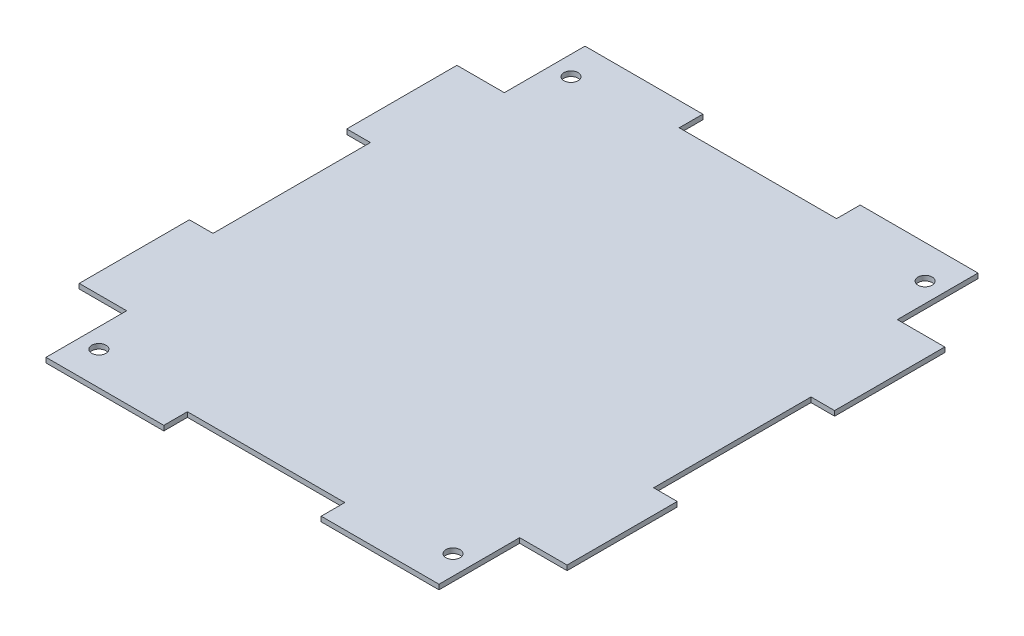
ISO-10303-21;
HEADER;
FILE_DESCRIPTION(('STEP AP214'),'2;1');
FILE_NAME('part.step','',(''),(''),'','','');
FILE_SCHEMA(('AUTOMOTIVE_DESIGN { 1 0 10303 214 1 1 1 1 }'));
ENDSEC;
DATA;
#1=APPLICATION_CONTEXT('core data for automotive mechanical design processes');
#2=APPLICATION_PROTOCOL_DEFINITION('international standard','automotive_design',2000,#1);
#3=PRODUCT_CONTEXT('',#1,'mechanical');
#4=PRODUCT('Part','Part','',(#3));
#5=PRODUCT_RELATED_PRODUCT_CATEGORY('part','',(#4));
#6=PRODUCT_DEFINITION_FORMATION('','',#4);
#7=PRODUCT_DEFINITION_CONTEXT('part definition',#1,'design');
#8=PRODUCT_DEFINITION('design','',#6,#7);
#9=PRODUCT_DEFINITION_SHAPE('','',#8);
#10=(LENGTH_UNIT() NAMED_UNIT(*) SI_UNIT(.MILLI.,.METRE.));
#11=(NAMED_UNIT(*) PLANE_ANGLE_UNIT() SI_UNIT($,.RADIAN.));
#12=(NAMED_UNIT(*) SI_UNIT($,.STERADIAN.) SOLID_ANGLE_UNIT());
#13=UNCERTAINTY_MEASURE_WITH_UNIT(LENGTH_MEASURE(1.E-05),#10,'distance_accuracy_value','');
#14=(GEOMETRIC_REPRESENTATION_CONTEXT(3) GLOBAL_UNCERTAINTY_ASSIGNED_CONTEXT((#13)) GLOBAL_UNIT_ASSIGNED_CONTEXT((#10,
#11,#12)) REPRESENTATION_CONTEXT('',''));
#15=CARTESIAN_POINT('',(0.,0.,0.));
#16=DIRECTION('',(0.,0.,1.));
#17=DIRECTION('',(1.,0.,0.));
#18=AXIS2_PLACEMENT_3D('',#15,#16,#17);
#19=CARTESIAN_POINT('',(0.,1.5875,0.));
#20=DIRECTION('',(0.,1.,0.));
#21=DIRECTION('',(0.,0.,1.));
#22=AXIS2_PLACEMENT_3D('',#19,#20,#21);
#23=PLANE('',#22);
#24=CARTESIAN_POINT('',(57.15,1.5875,76.2));
#25=DIRECTION('',(0.,1.,0.));
#26=DIRECTION('',(0.,0.,1.));
#27=AXIS2_PLACEMENT_3D('',#24,#25,#26);
#28=CIRCLE('',#27,2.28599999999999);
#29=CARTESIAN_POINT('',(57.15,1.5875,78.486));
#30=VERTEX_POINT('',#29);
#31=EDGE_CURVE('E503',#30,#30,#28,.T.);
#32=ORIENTED_EDGE('',*,*,#31,.F.);
#33=EDGE_LOOP('',(#32));
#34=FACE_BOUND('',#33,.T.);
#35=CARTESIAN_POINT('',(-57.15,1.5875,-76.2));
#36=DIRECTION('',(0.,1.,0.));
#37=DIRECTION('',(0.,0.,1.));
#38=AXIS2_PLACEMENT_3D('',#35,#36,#37);
#39=CIRCLE('',#38,2.28599999999999);
#40=CARTESIAN_POINT('',(-57.15,1.5875,-73.914));
#41=VERTEX_POINT('',#40);
#42=EDGE_CURVE('E258',#41,#41,#39,.T.);
#43=ORIENTED_EDGE('',*,*,#42,.F.);
#44=EDGE_LOOP('',(#43));
#45=FACE_BOUND('',#44,.T.);
#46=DIRECTION('',(0.,0.,1.));
#47=VECTOR('',#46,1.);
#48=CARTESIAN_POINT('',(-78.7400000000001,1.5875,25.4));
#49=LINE('',#48,#47);
#50=CARTESIAN_POINT('',(-78.7400000000001,1.5875,25.4));
#51=VERTEX_POINT('',#50);
#52=CARTESIAN_POINT('',(-78.74,1.5875,60.96));
#53=VERTEX_POINT('',#52);
#54=EDGE_CURVE('E309',#51,#53,#49,.T.);
#55=ORIENTED_EDGE('',*,*,#54,.T.);
#56=DIRECTION('',(1.,0.,0.));
#57=VECTOR('',#56,1.);
#58=CARTESIAN_POINT('',(-78.74,1.5875,60.96));
#59=LINE('',#58,#57);
#60=CARTESIAN_POINT('',(-63.43142,1.5875,60.96));
#61=VERTEX_POINT('',#60);
#62=EDGE_CURVE('E157',#53,#61,#59,.T.);
#63=ORIENTED_EDGE('',*,*,#62,.T.);
#64=DIRECTION('',(0.,0.,1.));
#65=VECTOR('',#64,1.);
#66=CARTESIAN_POINT('',(-63.43142,1.5875,60.96));
#67=LINE('',#66,#65);
#68=CARTESIAN_POINT('',(-63.43142,1.5875,86.995));
#69=VERTEX_POINT('',#68);
#70=EDGE_CURVE('E384',#61,#69,#67,.T.);
#71=ORIENTED_EDGE('',*,*,#70,.T.);
#72=DIRECTION('',(1.,0.,0.));
#73=VECTOR('',#72,1.);
#74=CARTESIAN_POINT('',(-63.43142,1.5875,86.995));
#75=LINE('',#74,#73);
#76=CARTESIAN_POINT('',(-25.4,1.5875,86.995));
#77=VERTEX_POINT('',#76);
#78=EDGE_CURVE('E403',#69,#77,#75,.T.);
#79=ORIENTED_EDGE('',*,*,#78,.T.);
#80=DIRECTION('',(0.,0.,-1.));
#81=VECTOR('',#80,1.);
#82=CARTESIAN_POINT('',(-25.4,1.5875,86.995));
#83=LINE('',#82,#81);
#84=CARTESIAN_POINT('',(-25.4,1.5875,79.375));
#85=VERTEX_POINT('',#84);
#86=EDGE_CURVE('E400',#77,#85,#83,.T.);
#87=ORIENTED_EDGE('',*,*,#86,.T.);
#88=DIRECTION('',(1.,0.,0.));
#89=VECTOR('',#88,1.);
#90=CARTESIAN_POINT('',(25.4,1.5875,79.375));
#91=LINE('',#90,#89);
#92=CARTESIAN_POINT('',(25.4,1.5875,79.375));
#93=VERTEX_POINT('',#92);
#94=EDGE_CURVE('E402',#85,#93,#91,.T.);
#95=ORIENTED_EDGE('',*,*,#94,.T.);
#96=DIRECTION('',(0.,0.,1.));
#97=VECTOR('',#96,1.);
#98=CARTESIAN_POINT('',(25.4,1.5875,86.995));
#99=LINE('',#98,#97);
#100=CARTESIAN_POINT('',(25.4,1.5875,86.995));
#101=VERTEX_POINT('',#100);
#102=EDGE_CURVE('E405',#93,#101,#99,.T.);
#103=ORIENTED_EDGE('',*,*,#102,.T.);
#104=DIRECTION('',(1.,0.,0.));
#105=VECTOR('',#104,1.);
#106=CARTESIAN_POINT('',(25.4,1.5875,86.995));
#107=LINE('',#106,#105);
#108=CARTESIAN_POINT('',(63.43142,1.5875,86.995));
#109=VERTEX_POINT('',#108);
#110=EDGE_CURVE('E411',#101,#109,#107,.T.);
#111=ORIENTED_EDGE('',*,*,#110,.T.);
#112=DIRECTION('',(0.,0.,-1.));
#113=VECTOR('',#112,1.);
#114=CARTESIAN_POINT('',(63.43142,1.5875,86.995));
#115=LINE('',#114,#113);
#116=CARTESIAN_POINT('',(63.43142,1.5875,60.96));
#117=VERTEX_POINT('',#116);
#118=EDGE_CURVE('E413',#109,#117,#115,.T.);
#119=ORIENTED_EDGE('',*,*,#118,.T.);
#120=DIRECTION('',(1.,0.,0.));
#121=VECTOR('',#120,1.);
#122=CARTESIAN_POINT('',(63.43142,1.5875,60.96));
#123=LINE('',#122,#121);
#124=CARTESIAN_POINT('',(78.74,1.5875,60.96));
#125=VERTEX_POINT('',#124);
#126=EDGE_CURVE('E415',#117,#125,#123,.T.);
#127=ORIENTED_EDGE('',*,*,#126,.T.);
#128=DIRECTION('',(0.,0.,-1.));
#129=VECTOR('',#128,1.);
#130=CARTESIAN_POINT('',(78.74,1.5875,60.96));
#131=LINE('',#130,#129);
#132=CARTESIAN_POINT('',(78.74,1.5875,25.4));
#133=VERTEX_POINT('',#132);
#134=EDGE_CURVE('E417',#125,#133,#131,.T.);
#135=ORIENTED_EDGE('',*,*,#134,.T.);
#136=DIRECTION('',(-1.,0.,0.));
#137=VECTOR('',#136,1.);
#138=CARTESIAN_POINT('',(78.74,1.5875,25.4));
#139=LINE('',#138,#137);
#140=CARTESIAN_POINT('',(71.12,1.5875,25.4));
#141=VERTEX_POINT('',#140);
#142=EDGE_CURVE('E419',#133,#141,#139,.T.);
#143=ORIENTED_EDGE('',*,*,#142,.T.);
#144=DIRECTION('',(0.,0.,-1.));
#145=VECTOR('',#144,1.);
#146=CARTESIAN_POINT('',(71.12,1.5875,-25.4));
#147=LINE('',#146,#145);
#148=CARTESIAN_POINT('',(71.12,1.5875,-25.4));
#149=VERTEX_POINT('',#148);
#150=EDGE_CURVE('E421',#141,#149,#147,.T.);
#151=ORIENTED_EDGE('',*,*,#150,.T.);
#152=DIRECTION('',(1.,0.,0.));
#153=VECTOR('',#152,1.);
#154=CARTESIAN_POINT('',(78.74,1.5875,-25.4));
#155=LINE('',#154,#153);
#156=CARTESIAN_POINT('',(78.74,1.5875,-25.4));
#157=VERTEX_POINT('',#156);
#158=EDGE_CURVE('E423',#149,#157,#155,.T.);
#159=ORIENTED_EDGE('',*,*,#158,.T.);
#160=DIRECTION('',(0.,0.,-1.));
#161=VECTOR('',#160,1.);
#162=CARTESIAN_POINT('',(78.74,1.5875,-25.4));
#163=LINE('',#162,#161);
#164=CARTESIAN_POINT('',(78.74,1.5875,-60.96));
#165=VERTEX_POINT('',#164);
#166=EDGE_CURVE('E425',#157,#165,#163,.T.);
#167=ORIENTED_EDGE('',*,*,#166,.T.);
#168=DIRECTION('',(-1.,0.,0.));
#169=VECTOR('',#168,1.);
#170=CARTESIAN_POINT('',(78.74,1.5875,-60.96));
#171=LINE('',#170,#169);
#172=CARTESIAN_POINT('',(63.43142,1.5875,-60.96));
#173=VERTEX_POINT('',#172);
#174=EDGE_CURVE('E427',#165,#173,#171,.T.);
#175=ORIENTED_EDGE('',*,*,#174,.T.);
#176=DIRECTION('',(0.,0.,-1.));
#177=VECTOR('',#176,1.);
#178=CARTESIAN_POINT('',(63.43142,1.5875,-60.96));
#179=LINE('',#178,#177);
#180=CARTESIAN_POINT('',(63.43142,1.5875,-86.995));
#181=VERTEX_POINT('',#180);
#182=EDGE_CURVE('E429',#173,#181,#179,.T.);
#183=ORIENTED_EDGE('',*,*,#182,.T.);
#184=DIRECTION('',(-1.,0.,0.));
#185=VECTOR('',#184,1.);
#186=CARTESIAN_POINT('',(63.43142,1.5875,-86.995));
#187=LINE('',#186,#185);
#188=CARTESIAN_POINT('',(25.4,1.5875,-86.995));
#189=VERTEX_POINT('',#188);
#190=EDGE_CURVE('E431',#181,#189,#187,.T.);
#191=ORIENTED_EDGE('',*,*,#190,.T.);
#192=DIRECTION('',(0.,0.,1.));
#193=VECTOR('',#192,1.);
#194=CARTESIAN_POINT('',(25.4,1.5875,-86.995));
#195=LINE('',#194,#193);
#196=CARTESIAN_POINT('',(25.4,1.5875,-79.375));
#197=VERTEX_POINT('',#196);
#198=EDGE_CURVE('E433',#189,#197,#195,.T.);
#199=ORIENTED_EDGE('',*,*,#198,.T.);
#200=DIRECTION('',(-1.,0.,0.));
#201=VECTOR('',#200,1.);
#202=CARTESIAN_POINT('',(-25.4,1.5875,-79.375));
#203=LINE('',#202,#201);
#204=CARTESIAN_POINT('',(-25.4,1.5875,-79.375));
#205=VERTEX_POINT('',#204);
#206=EDGE_CURVE('E435',#197,#205,#203,.T.);
#207=ORIENTED_EDGE('',*,*,#206,.T.);
#208=DIRECTION('',(0.,0.,-1.));
#209=VECTOR('',#208,1.);
#210=CARTESIAN_POINT('',(-25.4,1.5875,-86.995));
#211=LINE('',#210,#209);
#212=CARTESIAN_POINT('',(-25.4,1.5875,-86.995));
#213=VERTEX_POINT('',#212);
#214=EDGE_CURVE('E437',#205,#213,#211,.T.);
#215=ORIENTED_EDGE('',*,*,#214,.T.);
#216=DIRECTION('',(-1.,0.,0.));
#217=VECTOR('',#216,1.);
#218=CARTESIAN_POINT('',(-25.4,1.5875,-86.995));
#219=LINE('',#218,#217);
#220=CARTESIAN_POINT('',(-63.43142,1.5875,-86.995));
#221=VERTEX_POINT('',#220);
#222=EDGE_CURVE('E439',#213,#221,#219,.T.);
#223=ORIENTED_EDGE('',*,*,#222,.T.);
#224=DIRECTION('',(0.,0.,1.));
#225=VECTOR('',#224,1.);
#226=CARTESIAN_POINT('',(-63.43142,1.5875,-86.995));
#227=LINE('',#226,#225);
#228=CARTESIAN_POINT('',(-63.43142,1.5875,-60.96));
#229=VERTEX_POINT('',#228);
#230=EDGE_CURVE('E441',#221,#229,#227,.T.);
#231=ORIENTED_EDGE('',*,*,#230,.T.);
#232=DIRECTION('',(-1.,0.,0.));
#233=VECTOR('',#232,1.);
#234=CARTESIAN_POINT('',(-63.43142,1.5875,-60.96));
#235=LINE('',#234,#233);
#236=CARTESIAN_POINT('',(-78.74,1.5875,-60.96));
#237=VERTEX_POINT('',#236);
#238=EDGE_CURVE('E443',#229,#237,#235,.T.);
#239=ORIENTED_EDGE('',*,*,#238,.T.);
#240=DIRECTION('',(0.,0.,1.));
#241=VECTOR('',#240,1.);
#242=CARTESIAN_POINT('',(-78.74,1.5875,-60.96));
#243=LINE('',#242,#241);
#244=CARTESIAN_POINT('',(-78.7400000000001,1.5875,-25.4));
#245=VERTEX_POINT('',#244);
#246=EDGE_CURVE('E236',#237,#245,#243,.T.);
#247=ORIENTED_EDGE('',*,*,#246,.T.);
#248=DIRECTION('',(1.,0.,0.));
#249=VECTOR('',#248,1.);
#250=CARTESIAN_POINT('',(-78.7400000000001,1.5875,-25.4));
#251=LINE('',#250,#249);
#252=CARTESIAN_POINT('',(-71.12,1.5875,-25.4));
#253=VERTEX_POINT('',#252);
#254=EDGE_CURVE('E230',#245,#253,#251,.T.);
#255=ORIENTED_EDGE('',*,*,#254,.T.);
#256=DIRECTION('',(0.,0.,1.));
#257=VECTOR('',#256,1.);
#258=CARTESIAN_POINT('',(-71.12,1.5875,25.4));
#259=LINE('',#258,#257);
#260=CARTESIAN_POINT('',(-71.12,1.5875,25.4));
#261=VERTEX_POINT('',#260);
#262=EDGE_CURVE('E234',#253,#261,#259,.T.);
#263=ORIENTED_EDGE('',*,*,#262,.T.);
#264=DIRECTION('',(-1.,0.,0.));
#265=VECTOR('',#264,1.);
#266=CARTESIAN_POINT('',(-78.7400000000001,1.5875,25.4));
#267=LINE('',#266,#265);
#268=EDGE_CURVE('E54',#261,#51,#267,.T.);
#269=ORIENTED_EDGE('',*,*,#268,.T.);
#270=EDGE_LOOP('',(#55,#63,#71,#79,#87,#95,#103,#111,#119,#127,#135,#143,#151,#159,#167,#175,
#183,#191,#199,#207,#215,#223,#231,#239,#247,#255,#263,#269));
#271=FACE_BOUND('',#270,.T.);
#272=CARTESIAN_POINT('',(57.15,1.5875,-76.2));
#273=DIRECTION('',(0.,1.,0.));
#274=DIRECTION('',(0.,0.,1.));
#275=AXIS2_PLACEMENT_3D('',#272,#273,#274);
#276=CIRCLE('',#275,2.28599999999999);
#277=CARTESIAN_POINT('',(57.15,1.5875,-73.914));
#278=VERTEX_POINT('',#277);
#279=EDGE_CURVE('E509',#278,#278,#276,.T.);
#280=ORIENTED_EDGE('',*,*,#279,.F.);
#281=EDGE_LOOP('',(#280));
#282=FACE_BOUND('',#281,.T.);
#283=CARTESIAN_POINT('',(-57.1500000000003,1.5875,76.2));
#284=DIRECTION('',(0.,1.,0.));
#285=DIRECTION('',(0.,0.,1.));
#286=AXIS2_PLACEMENT_3D('',#283,#284,#285);
#287=CIRCLE('',#286,2.2860000000002);
#288=CARTESIAN_POINT('',(-57.1500000000003,1.5875,78.4860000000002));
#289=VERTEX_POINT('',#288);
#290=EDGE_CURVE('E494',#289,#289,#287,.T.);
#291=ORIENTED_EDGE('',*,*,#290,.F.);
#292=EDGE_LOOP('',(#291));
#293=FACE_BOUND('',#292,.T.);
#294=ADVANCED_FACE('F37',(#34,#45,#271,#282,#293),#23,.T.);
#295=CARTESIAN_POINT('',(0.,0.,0.));
#296=DIRECTION('',(0.,1.,0.));
#297=DIRECTION('',(0.,0.,1.));
#298=AXIS2_PLACEMENT_3D('',#295,#296,#297);
#299=PLANE('',#298);
#300=DIRECTION('',(0.,0.,1.));
#301=VECTOR('',#300,1.);
#302=CARTESIAN_POINT('',(-78.7400000000001,0.,25.4));
#303=LINE('',#302,#301);
#304=CARTESIAN_POINT('',(-78.7400000000001,0.,25.4));
#305=VERTEX_POINT('',#304);
#306=CARTESIAN_POINT('',(-78.74,0.,60.96));
#307=VERTEX_POINT('',#306);
#308=EDGE_CURVE('E254',#305,#307,#303,.T.);
#309=ORIENTED_EDGE('',*,*,#308,.F.);
#310=DIRECTION('',(-1.,0.,0.));
#311=VECTOR('',#310,1.);
#312=CARTESIAN_POINT('',(-78.7400000000001,0.,25.4));
#313=LINE('',#312,#311);
#314=CARTESIAN_POINT('',(-71.12,0.,25.4));
#315=VERTEX_POINT('',#314);
#316=EDGE_CURVE('E149',#315,#305,#313,.T.);
#317=ORIENTED_EDGE('',*,*,#316,.F.);
#318=DIRECTION('',(0.,0.,1.));
#319=VECTOR('',#318,1.);
#320=CARTESIAN_POINT('',(-71.12,0.,25.4));
#321=LINE('',#320,#319);
#322=CARTESIAN_POINT('',(-71.12,0.,-25.4));
#323=VERTEX_POINT('',#322);
#324=EDGE_CURVE('E143',#323,#315,#321,.T.);
#325=ORIENTED_EDGE('',*,*,#324,.F.);
#326=DIRECTION('',(1.,0.,0.));
#327=VECTOR('',#326,1.);
#328=CARTESIAN_POINT('',(-78.7400000000001,0.,-25.4));
#329=LINE('',#328,#327);
#330=CARTESIAN_POINT('',(-78.7400000000001,0.,-25.4));
#331=VERTEX_POINT('',#330);
#332=EDGE_CURVE('E244',#331,#323,#329,.T.);
#333=ORIENTED_EDGE('',*,*,#332,.F.);
#334=DIRECTION('',(0.,0.,1.));
#335=VECTOR('',#334,1.);
#336=CARTESIAN_POINT('',(-78.74,0.,-60.96));
#337=LINE('',#336,#335);
#338=CARTESIAN_POINT('',(-78.74,0.,-60.96));
#339=VERTEX_POINT('',#338);
#340=EDGE_CURVE('E304',#339,#331,#337,.T.);
#341=ORIENTED_EDGE('',*,*,#340,.F.);
#342=DIRECTION('',(-1.,0.,0.));
#343=VECTOR('',#342,1.);
#344=CARTESIAN_POINT('',(-63.43142,0.,-60.96));
#345=LINE('',#344,#343);
#346=CARTESIAN_POINT('',(-63.43142,0.,-60.96));
#347=VERTEX_POINT('',#346);
#348=EDGE_CURVE('E302',#347,#339,#345,.T.);
#349=ORIENTED_EDGE('',*,*,#348,.F.);
#350=DIRECTION('',(0.,0.,1.));
#351=VECTOR('',#350,1.);
#352=CARTESIAN_POINT('',(-63.43142,0.,-86.995));
#353=LINE('',#352,#351);
#354=CARTESIAN_POINT('',(-63.43142,0.,-86.995));
#355=VERTEX_POINT('',#354);
#356=EDGE_CURVE('E300',#355,#347,#353,.T.);
#357=ORIENTED_EDGE('',*,*,#356,.F.);
#358=DIRECTION('',(-1.,0.,0.));
#359=VECTOR('',#358,1.);
#360=CARTESIAN_POINT('',(-25.4,0.,-86.995));
#361=LINE('',#360,#359);
#362=CARTESIAN_POINT('',(-25.4,0.,-86.995));
#363=VERTEX_POINT('',#362);
#364=EDGE_CURVE('E298',#363,#355,#361,.T.);
#365=ORIENTED_EDGE('',*,*,#364,.F.);
#366=DIRECTION('',(0.,0.,-1.));
#367=VECTOR('',#366,1.);
#368=CARTESIAN_POINT('',(-25.4,0.,-86.995));
#369=LINE('',#368,#367);
#370=CARTESIAN_POINT('',(-25.4,0.,-79.375));
#371=VERTEX_POINT('',#370);
#372=EDGE_CURVE('E296',#371,#363,#369,.T.);
#373=ORIENTED_EDGE('',*,*,#372,.F.);
#374=DIRECTION('',(-1.,0.,0.));
#375=VECTOR('',#374,1.);
#376=CARTESIAN_POINT('',(-25.4,0.,-79.375));
#377=LINE('',#376,#375);
#378=CARTESIAN_POINT('',(25.4,0.,-79.375));
#379=VERTEX_POINT('',#378);
#380=EDGE_CURVE('E294',#379,#371,#377,.T.);
#381=ORIENTED_EDGE('',*,*,#380,.F.);
#382=DIRECTION('',(0.,0.,1.));
#383=VECTOR('',#382,1.);
#384=CARTESIAN_POINT('',(25.4,0.,-86.995));
#385=LINE('',#384,#383);
#386=CARTESIAN_POINT('',(25.4,0.,-86.995));
#387=VERTEX_POINT('',#386);
#388=EDGE_CURVE('E292',#387,#379,#385,.T.);
#389=ORIENTED_EDGE('',*,*,#388,.F.);
#390=DIRECTION('',(-1.,0.,0.));
#391=VECTOR('',#390,1.);
#392=CARTESIAN_POINT('',(63.43142,0.,-86.995));
#393=LINE('',#392,#391);
#394=CARTESIAN_POINT('',(63.43142,0.,-86.995));
#395=VERTEX_POINT('',#394);
#396=EDGE_CURVE('E290',#395,#387,#393,.T.);
#397=ORIENTED_EDGE('',*,*,#396,.F.);
#398=DIRECTION('',(0.,0.,-1.));
#399=VECTOR('',#398,1.);
#400=CARTESIAN_POINT('',(63.43142,0.,-60.96));
#401=LINE('',#400,#399);
#402=CARTESIAN_POINT('',(63.43142,0.,-60.96));
#403=VERTEX_POINT('',#402);
#404=EDGE_CURVE('E288',#403,#395,#401,.T.);
#405=ORIENTED_EDGE('',*,*,#404,.F.);
#406=DIRECTION('',(-1.,0.,0.));
#407=VECTOR('',#406,1.);
#408=CARTESIAN_POINT('',(78.74,0.,-60.96));
#409=LINE('',#408,#407);
#410=CARTESIAN_POINT('',(78.74,0.,-60.96));
#411=VERTEX_POINT('',#410);
#412=EDGE_CURVE('E286',#411,#403,#409,.T.);
#413=ORIENTED_EDGE('',*,*,#412,.F.);
#414=DIRECTION('',(0.,0.,-1.));
#415=VECTOR('',#414,1.);
#416=CARTESIAN_POINT('',(78.74,0.,-25.4));
#417=LINE('',#416,#415);
#418=CARTESIAN_POINT('',(78.74,0.,-25.4));
#419=VERTEX_POINT('',#418);
#420=EDGE_CURVE('E284',#419,#411,#417,.T.);
#421=ORIENTED_EDGE('',*,*,#420,.F.);
#422=DIRECTION('',(1.,0.,0.));
#423=VECTOR('',#422,1.);
#424=CARTESIAN_POINT('',(78.74,0.,-25.4));
#425=LINE('',#424,#423);
#426=CARTESIAN_POINT('',(71.12,0.,-25.4));
#427=VERTEX_POINT('',#426);
#428=EDGE_CURVE('E282',#427,#419,#425,.T.);
#429=ORIENTED_EDGE('',*,*,#428,.F.);
#430=DIRECTION('',(0.,0.,-1.));
#431=VECTOR('',#430,1.);
#432=CARTESIAN_POINT('',(71.12,0.,-25.4));
#433=LINE('',#432,#431);
#434=CARTESIAN_POINT('',(71.12,0.,25.4));
#435=VERTEX_POINT('',#434);
#436=EDGE_CURVE('E280',#435,#427,#433,.T.);
#437=ORIENTED_EDGE('',*,*,#436,.F.);
#438=DIRECTION('',(-1.,0.,0.));
#439=VECTOR('',#438,1.);
#440=CARTESIAN_POINT('',(78.74,0.,25.4));
#441=LINE('',#440,#439);
#442=CARTESIAN_POINT('',(78.74,0.,25.4));
#443=VERTEX_POINT('',#442);
#444=EDGE_CURVE('E278',#443,#435,#441,.T.);
#445=ORIENTED_EDGE('',*,*,#444,.F.);
#446=DIRECTION('',(0.,0.,-1.));
#447=VECTOR('',#446,1.);
#448=CARTESIAN_POINT('',(78.74,0.,60.96));
#449=LINE('',#448,#447);
#450=CARTESIAN_POINT('',(78.74,0.,60.96));
#451=VERTEX_POINT('',#450);
#452=EDGE_CURVE('E276',#451,#443,#449,.T.);
#453=ORIENTED_EDGE('',*,*,#452,.F.);
#454=DIRECTION('',(1.,0.,0.));
#455=VECTOR('',#454,1.);
#456=CARTESIAN_POINT('',(63.43142,0.,60.96));
#457=LINE('',#456,#455);
#458=CARTESIAN_POINT('',(63.43142,0.,60.96));
#459=VERTEX_POINT('',#458);
#460=EDGE_CURVE('E274',#459,#451,#457,.T.);
#461=ORIENTED_EDGE('',*,*,#460,.F.);
#462=DIRECTION('',(0.,0.,-1.));
#463=VECTOR('',#462,1.);
#464=CARTESIAN_POINT('',(63.43142,0.,86.995));
#465=LINE('',#464,#463);
#466=CARTESIAN_POINT('',(63.43142,0.,86.995));
#467=VERTEX_POINT('',#466);
#468=EDGE_CURVE('E272',#467,#459,#465,.T.);
#469=ORIENTED_EDGE('',*,*,#468,.F.);
#470=DIRECTION('',(1.,0.,0.));
#471=VECTOR('',#470,1.);
#472=CARTESIAN_POINT('',(25.4,0.,86.995));
#473=LINE('',#472,#471);
#474=CARTESIAN_POINT('',(25.4,0.,86.995));
#475=VERTEX_POINT('',#474);
#476=EDGE_CURVE('E270',#475,#467,#473,.T.);
#477=ORIENTED_EDGE('',*,*,#476,.F.);
#478=DIRECTION('',(0.,0.,1.));
#479=VECTOR('',#478,1.);
#480=CARTESIAN_POINT('',(25.4,0.,86.995));
#481=LINE('',#480,#479);
#482=CARTESIAN_POINT('',(25.4,0.,79.375));
#483=VERTEX_POINT('',#482);
#484=EDGE_CURVE('E268',#483,#475,#481,.T.);
#485=ORIENTED_EDGE('',*,*,#484,.F.);
#486=DIRECTION('',(1.,0.,0.));
#487=VECTOR('',#486,1.);
#488=CARTESIAN_POINT('',(25.4,0.,79.375));
#489=LINE('',#488,#487);
#490=CARTESIAN_POINT('',(-25.4,0.,79.375));
#491=VERTEX_POINT('',#490);
#492=EDGE_CURVE('E266',#491,#483,#489,.T.);
#493=ORIENTED_EDGE('',*,*,#492,.F.);
#494=DIRECTION('',(0.,0.,-1.));
#495=VECTOR('',#494,1.);
#496=CARTESIAN_POINT('',(-25.4,0.,86.995));
#497=LINE('',#496,#495);
#498=CARTESIAN_POINT('',(-25.4,0.,86.995));
#499=VERTEX_POINT('',#498);
#500=EDGE_CURVE('E264',#499,#491,#497,.T.);
#501=ORIENTED_EDGE('',*,*,#500,.F.);
#502=DIRECTION('',(1.,0.,0.));
#503=VECTOR('',#502,1.);
#504=CARTESIAN_POINT('',(-63.43142,0.,86.995));
#505=LINE('',#504,#503);
#506=CARTESIAN_POINT('',(-63.43142,0.,86.995));
#507=VERTEX_POINT('',#506);
#508=EDGE_CURVE('E262',#507,#499,#505,.T.);
#509=ORIENTED_EDGE('',*,*,#508,.F.);
#510=DIRECTION('',(0.,0.,1.));
#511=VECTOR('',#510,1.);
#512=CARTESIAN_POINT('',(-63.43142,0.,60.96));
#513=LINE('',#512,#511);
#514=CARTESIAN_POINT('',(-63.43142,0.,60.96));
#515=VERTEX_POINT('',#514);
#516=EDGE_CURVE('E260',#515,#507,#513,.T.);
#517=ORIENTED_EDGE('',*,*,#516,.F.);
#518=DIRECTION('',(1.,0.,0.));
#519=VECTOR('',#518,1.);
#520=CARTESIAN_POINT('',(-78.74,0.,60.96));
#521=LINE('',#520,#519);
#522=EDGE_CURVE('E257',#307,#515,#521,.T.);
#523=ORIENTED_EDGE('',*,*,#522,.F.);
#524=EDGE_LOOP('',(#309,#317,#325,#333,#341,#349,#357,#365,#373,#381,#389,#397,#405,#413,#421,
#429,#437,#445,#453,#461,#469,#477,#485,#493,#501,#509,#517,#523));
#525=FACE_BOUND('',#524,.T.);
#526=CARTESIAN_POINT('',(-57.15,0.,-76.2));
#527=DIRECTION('',(0.,1.,0.));
#528=DIRECTION('',(0.,0.,1.));
#529=AXIS2_PLACEMENT_3D('',#526,#527,#528);
#530=CIRCLE('',#529,2.28599999999999);
#531=CARTESIAN_POINT('',(-57.15,0.,-73.914));
#532=VERTEX_POINT('',#531);
#533=EDGE_CURVE('E512',#532,#532,#530,.T.);
#534=ORIENTED_EDGE('',*,*,#533,.T.);
#535=EDGE_LOOP('',(#534));
#536=FACE_BOUND('',#535,.T.);
#537=CARTESIAN_POINT('',(57.15,0.,-76.2));
#538=DIRECTION('',(0.,1.,0.));
#539=DIRECTION('',(0.,0.,1.));
#540=AXIS2_PLACEMENT_3D('',#537,#538,#539);
#541=CIRCLE('',#540,2.28599999999999);
#542=CARTESIAN_POINT('',(57.15,0.,-73.914));
#543=VERTEX_POINT('',#542);
#544=EDGE_CURVE('E506',#543,#543,#541,.T.);
#545=ORIENTED_EDGE('',*,*,#544,.T.);
#546=EDGE_LOOP('',(#545));
#547=FACE_BOUND('',#546,.T.);
#548=CARTESIAN_POINT('',(57.15,0.,76.2));
#549=DIRECTION('',(0.,1.,0.));
#550=DIRECTION('',(0.,0.,1.));
#551=AXIS2_PLACEMENT_3D('',#548,#549,#550);
#552=CIRCLE('',#551,2.28599999999999);
#553=CARTESIAN_POINT('',(57.15,0.,78.486));
#554=VERTEX_POINT('',#553);
#555=EDGE_CURVE('E500',#554,#554,#552,.T.);
#556=ORIENTED_EDGE('',*,*,#555,.T.);
#557=EDGE_LOOP('',(#556));
#558=FACE_BOUND('',#557,.T.);
#559=CARTESIAN_POINT('',(-57.1500000000003,0.,76.2));
#560=DIRECTION('',(0.,1.,0.));
#561=DIRECTION('',(0.,0.,1.));
#562=AXIS2_PLACEMENT_3D('',#559,#560,#561);
#563=CIRCLE('',#562,2.2860000000002);
#564=CARTESIAN_POINT('',(-57.1500000000003,0.,78.4860000000002));
#565=VERTEX_POINT('',#564);
#566=EDGE_CURVE('E497',#565,#565,#563,.T.);
#567=ORIENTED_EDGE('',*,*,#566,.T.);
#568=EDGE_LOOP('',(#567));
#569=FACE_BOUND('',#568,.T.);
#570=ADVANCED_FACE('F388',(#525,#536,#547,#558,#569),#299,.F.);
#571=CARTESIAN_POINT('',(-78.7400000000001,1.5875,25.4));
#572=DIRECTION('',(1.,0.,0.));
#573=DIRECTION('',(0.,0.,-1.));
#574=AXIS2_PLACEMENT_3D('',#571,#572,#573);
#575=PLANE('',#574);
#576=ORIENTED_EDGE('',*,*,#308,.T.);
#577=DIRECTION('',(0.,-1.,0.));
#578=VECTOR('',#577,1.);
#579=CARTESIAN_POINT('',(-78.74,1.5875,60.96));
#580=LINE('',#579,#578);
#581=EDGE_CURVE('E11',#53,#307,#580,.T.);
#582=ORIENTED_EDGE('',*,*,#581,.F.);
#583=ORIENTED_EDGE('',*,*,#54,.F.);
#584=DIRECTION('',(0.,-1.,0.));
#585=VECTOR('',#584,1.);
#586=CARTESIAN_POINT('',(-78.7400000000001,1.5875,25.4));
#587=LINE('',#586,#585);
#588=EDGE_CURVE('E250',#51,#305,#587,.T.);
#589=ORIENTED_EDGE('',*,*,#588,.T.);
#590=EDGE_LOOP('',(#576,#582,#583,#589));
#591=FACE_BOUND('',#590,.T.);
#592=ADVANCED_FACE('F39',(#591),#575,.F.);
#593=CARTESIAN_POINT('',(-78.74,1.5875,60.96));
#594=DIRECTION('',(0.,0.,-1.));
#595=DIRECTION('',(-1.,0.,0.));
#596=AXIS2_PLACEMENT_3D('',#593,#594,#595);
#597=PLANE('',#596);
#598=ORIENTED_EDGE('',*,*,#522,.T.);
#599=DIRECTION('',(0.,-1.,0.));
#600=VECTOR('',#599,1.);
#601=CARTESIAN_POINT('',(-63.43142,1.5875,60.96));
#602=LINE('',#601,#600);
#603=EDGE_CURVE('E46',#61,#515,#602,.T.);
#604=ORIENTED_EDGE('',*,*,#603,.F.);
#605=ORIENTED_EDGE('',*,*,#62,.F.);
#606=ORIENTED_EDGE('',*,*,#581,.T.);
#607=EDGE_LOOP('',(#598,#604,#605,#606));
#608=FACE_BOUND('',#607,.T.);
#609=ADVANCED_FACE('F782',(#608),#597,.F.);
#610=CARTESIAN_POINT('',(-63.43142,1.5875,60.96));
#611=DIRECTION('',(1.,0.,0.));
#612=DIRECTION('',(0.,0.,-1.));
#613=AXIS2_PLACEMENT_3D('',#610,#611,#612);
#614=PLANE('',#613);
#615=ORIENTED_EDGE('',*,*,#516,.T.);
#616=DIRECTION('',(0.,-1.,0.));
#617=VECTOR('',#616,1.);
#618=CARTESIAN_POINT('',(-63.43142,1.5875,86.995));
#619=LINE('',#618,#617);
#620=EDGE_CURVE('E376',#69,#507,#619,.T.);
#621=ORIENTED_EDGE('',*,*,#620,.F.);
#622=ORIENTED_EDGE('',*,*,#70,.F.);
#623=ORIENTED_EDGE('',*,*,#603,.T.);
#624=EDGE_LOOP('',(#615,#621,#622,#623));
#625=FACE_BOUND('',#624,.T.);
#626=ADVANCED_FACE('F382',(#625),#614,.F.);
#627=CARTESIAN_POINT('',(-63.43142,1.5875,86.995));
#628=DIRECTION('',(0.,0.,-1.));
#629=DIRECTION('',(-1.,0.,0.));
#630=AXIS2_PLACEMENT_3D('',#627,#628,#629);
#631=PLANE('',#630);
#632=ORIENTED_EDGE('',*,*,#508,.T.);
#633=DIRECTION('',(0.,-1.,0.));
#634=VECTOR('',#633,1.);
#635=CARTESIAN_POINT('',(-25.4,1.5875,86.995));
#636=LINE('',#635,#634);
#637=EDGE_CURVE('E373',#77,#499,#636,.T.);
#638=ORIENTED_EDGE('',*,*,#637,.F.);
#639=ORIENTED_EDGE('',*,*,#78,.F.);
#640=ORIENTED_EDGE('',*,*,#620,.T.);
#641=EDGE_LOOP('',(#632,#638,#639,#640));
#642=FACE_BOUND('',#641,.T.);
#643=ADVANCED_FACE('F394',(#642),#631,.F.);
#644=CARTESIAN_POINT('',(-25.4,1.5875,86.995));
#645=DIRECTION('',(-1.,0.,0.));
#646=DIRECTION('',(0.,0.,1.));
#647=AXIS2_PLACEMENT_3D('',#644,#645,#646);
#648=PLANE('',#647);
#649=ORIENTED_EDGE('',*,*,#500,.T.);
#650=DIRECTION('',(0.,-1.,0.));
#651=VECTOR('',#650,1.);
#652=CARTESIAN_POINT('',(-25.4,1.5875,79.375));
#653=LINE('',#652,#651);
#654=EDGE_CURVE('E370',#85,#491,#653,.T.);
#655=ORIENTED_EDGE('',*,*,#654,.F.);
#656=ORIENTED_EDGE('',*,*,#86,.F.);
#657=ORIENTED_EDGE('',*,*,#637,.T.);
#658=EDGE_LOOP('',(#649,#655,#656,#657));
#659=FACE_BOUND('',#658,.T.);
#660=ADVANCED_FACE('F398',(#659),#648,.F.);
#661=CARTESIAN_POINT('',(25.4,1.5875,79.375));
#662=DIRECTION('',(0.,0.,-1.));
#663=DIRECTION('',(-1.,0.,0.));
#664=AXIS2_PLACEMENT_3D('',#661,#662,#663);
#665=PLANE('',#664);
#666=ORIENTED_EDGE('',*,*,#492,.T.);
#667=DIRECTION('',(0.,-1.,0.));
#668=VECTOR('',#667,1.);
#669=CARTESIAN_POINT('',(25.4,1.5875,79.375));
#670=LINE('',#669,#668);
#671=EDGE_CURVE('E367',#93,#483,#670,.T.);
#672=ORIENTED_EDGE('',*,*,#671,.F.);
#673=ORIENTED_EDGE('',*,*,#94,.F.);
#674=ORIENTED_EDGE('',*,*,#654,.T.);
#675=EDGE_LOOP('',(#666,#672,#673,#674));
#676=FACE_BOUND('',#675,.T.);
#677=ADVANCED_FACE('F747',(#676),#665,.F.);
#678=CARTESIAN_POINT('',(25.4,1.5875,86.995));
#679=DIRECTION('',(1.,0.,0.));
#680=DIRECTION('',(0.,0.,-1.));
#681=AXIS2_PLACEMENT_3D('',#678,#679,#680);
#682=PLANE('',#681);
#683=ORIENTED_EDGE('',*,*,#484,.T.);
#684=DIRECTION('',(0.,-1.,0.));
#685=VECTOR('',#684,1.);
#686=CARTESIAN_POINT('',(25.4,1.5875,86.995));
#687=LINE('',#686,#685);
#688=EDGE_CURVE('E364',#101,#475,#687,.T.);
#689=ORIENTED_EDGE('',*,*,#688,.F.);
#690=ORIENTED_EDGE('',*,*,#102,.F.);
#691=ORIENTED_EDGE('',*,*,#671,.T.);
#692=EDGE_LOOP('',(#683,#689,#690,#691));
#693=FACE_BOUND('',#692,.T.);
#694=ADVANCED_FACE('F737',(#693),#682,.F.);
#695=CARTESIAN_POINT('',(25.4,1.5875,86.995));
#696=DIRECTION('',(0.,0.,-1.));
#697=DIRECTION('',(-1.,0.,0.));
#698=AXIS2_PLACEMENT_3D('',#695,#696,#697);
#699=PLANE('',#698);
#700=ORIENTED_EDGE('',*,*,#476,.T.);
#701=DIRECTION('',(0.,-1.,0.));
#702=VECTOR('',#701,1.);
#703=CARTESIAN_POINT('',(63.43142,1.5875,86.995));
#704=LINE('',#703,#702);
#705=EDGE_CURVE('E361',#109,#467,#704,.T.);
#706=ORIENTED_EDGE('',*,*,#705,.F.);
#707=ORIENTED_EDGE('',*,*,#110,.F.);
#708=ORIENTED_EDGE('',*,*,#688,.T.);
#709=EDGE_LOOP('',(#700,#706,#707,#708));
#710=FACE_BOUND('',#709,.T.);
#711=ADVANCED_FACE('F727',(#710),#699,.F.);
#712=CARTESIAN_POINT('',(63.43142,1.5875,86.995));
#713=DIRECTION('',(-1.,0.,0.));
#714=DIRECTION('',(0.,0.,1.));
#715=AXIS2_PLACEMENT_3D('',#712,#713,#714);
#716=PLANE('',#715);
#717=ORIENTED_EDGE('',*,*,#468,.T.);
#718=DIRECTION('',(0.,-1.,0.));
#719=VECTOR('',#718,1.);
#720=CARTESIAN_POINT('',(63.43142,1.5875,60.96));
#721=LINE('',#720,#719);
#722=EDGE_CURVE('E358',#117,#459,#721,.T.);
#723=ORIENTED_EDGE('',*,*,#722,.F.);
#724=ORIENTED_EDGE('',*,*,#118,.F.);
#725=ORIENTED_EDGE('',*,*,#705,.T.);
#726=EDGE_LOOP('',(#717,#723,#724,#725));
#727=FACE_BOUND('',#726,.T.);
#728=ADVANCED_FACE('F717',(#727),#716,.F.);
#729=CARTESIAN_POINT('',(63.43142,1.5875,60.96));
#730=DIRECTION('',(0.,0.,-1.));
#731=DIRECTION('',(-1.,0.,0.));
#732=AXIS2_PLACEMENT_3D('',#729,#730,#731);
#733=PLANE('',#732);
#734=ORIENTED_EDGE('',*,*,#460,.T.);
#735=DIRECTION('',(0.,-1.,0.));
#736=VECTOR('',#735,1.);
#737=CARTESIAN_POINT('',(78.74,1.5875,60.96));
#738=LINE('',#737,#736);
#739=EDGE_CURVE('E355',#125,#451,#738,.T.);
#740=ORIENTED_EDGE('',*,*,#739,.F.);
#741=ORIENTED_EDGE('',*,*,#126,.F.);
#742=ORIENTED_EDGE('',*,*,#722,.T.);
#743=EDGE_LOOP('',(#734,#740,#741,#742));
#744=FACE_BOUND('',#743,.T.);
#745=ADVANCED_FACE('F707',(#744),#733,.F.);
#746=CARTESIAN_POINT('',(78.74,1.5875,60.96));
#747=DIRECTION('',(-1.,0.,0.));
#748=DIRECTION('',(0.,0.,1.));
#749=AXIS2_PLACEMENT_3D('',#746,#747,#748);
#750=PLANE('',#749);
#751=ORIENTED_EDGE('',*,*,#452,.T.);
#752=DIRECTION('',(0.,-1.,0.));
#753=VECTOR('',#752,1.);
#754=CARTESIAN_POINT('',(78.74,1.5875,25.4));
#755=LINE('',#754,#753);
#756=EDGE_CURVE('E352',#133,#443,#755,.T.);
#757=ORIENTED_EDGE('',*,*,#756,.F.);
#758=ORIENTED_EDGE('',*,*,#134,.F.);
#759=ORIENTED_EDGE('',*,*,#739,.T.);
#760=EDGE_LOOP('',(#751,#757,#758,#759));
#761=FACE_BOUND('',#760,.T.);
#762=ADVANCED_FACE('F697',(#761),#750,.F.);
#763=CARTESIAN_POINT('',(78.74,1.5875,25.4));
#764=DIRECTION('',(0.,0.,1.));
#765=DIRECTION('',(1.,0.,0.));
#766=AXIS2_PLACEMENT_3D('',#763,#764,#765);
#767=PLANE('',#766);
#768=ORIENTED_EDGE('',*,*,#444,.T.);
#769=DIRECTION('',(0.,-1.,0.));
#770=VECTOR('',#769,1.);
#771=CARTESIAN_POINT('',(71.12,1.5875,25.4));
#772=LINE('',#771,#770);
#773=EDGE_CURVE('E349',#141,#435,#772,.T.);
#774=ORIENTED_EDGE('',*,*,#773,.F.);
#775=ORIENTED_EDGE('',*,*,#142,.F.);
#776=ORIENTED_EDGE('',*,*,#756,.T.);
#777=EDGE_LOOP('',(#768,#774,#775,#776));
#778=FACE_BOUND('',#777,.T.);
#779=ADVANCED_FACE('F687',(#778),#767,.F.);
#780=CARTESIAN_POINT('',(71.12,1.5875,-25.4));
#781=DIRECTION('',(-1.,0.,0.));
#782=DIRECTION('',(0.,0.,1.));
#783=AXIS2_PLACEMENT_3D('',#780,#781,#782);
#784=PLANE('',#783);
#785=ORIENTED_EDGE('',*,*,#436,.T.);
#786=DIRECTION('',(0.,-1.,0.));
#787=VECTOR('',#786,1.);
#788=CARTESIAN_POINT('',(71.12,1.5875,-25.4));
#789=LINE('',#788,#787);
#790=EDGE_CURVE('E346',#149,#427,#789,.T.);
#791=ORIENTED_EDGE('',*,*,#790,.F.);
#792=ORIENTED_EDGE('',*,*,#150,.F.);
#793=ORIENTED_EDGE('',*,*,#773,.T.);
#794=EDGE_LOOP('',(#785,#791,#792,#793));
#795=FACE_BOUND('',#794,.T.);
#796=ADVANCED_FACE('F677',(#795),#784,.F.);
#797=CARTESIAN_POINT('',(78.74,1.5875,-25.4));
#798=DIRECTION('',(0.,0.,-1.));
#799=DIRECTION('',(-1.,0.,0.));
#800=AXIS2_PLACEMENT_3D('',#797,#798,#799);
#801=PLANE('',#800);
#802=ORIENTED_EDGE('',*,*,#428,.T.);
#803=DIRECTION('',(0.,-1.,0.));
#804=VECTOR('',#803,1.);
#805=CARTESIAN_POINT('',(78.74,1.5875,-25.4));
#806=LINE('',#805,#804);
#807=EDGE_CURVE('E343',#157,#419,#806,.T.);
#808=ORIENTED_EDGE('',*,*,#807,.F.);
#809=ORIENTED_EDGE('',*,*,#158,.F.);
#810=ORIENTED_EDGE('',*,*,#790,.T.);
#811=EDGE_LOOP('',(#802,#808,#809,#810));
#812=FACE_BOUND('',#811,.T.);
#813=ADVANCED_FACE('F667',(#812),#801,.F.);
#814=CARTESIAN_POINT('',(78.74,1.5875,-25.4));
#815=DIRECTION('',(-1.,0.,0.));
#816=DIRECTION('',(0.,0.,1.));
#817=AXIS2_PLACEMENT_3D('',#814,#815,#816);
#818=PLANE('',#817);
#819=ORIENTED_EDGE('',*,*,#420,.T.);
#820=DIRECTION('',(0.,-1.,0.));
#821=VECTOR('',#820,1.);
#822=CARTESIAN_POINT('',(78.74,1.5875,-60.96));
#823=LINE('',#822,#821);
#824=EDGE_CURVE('E340',#165,#411,#823,.T.);
#825=ORIENTED_EDGE('',*,*,#824,.F.);
#826=ORIENTED_EDGE('',*,*,#166,.F.);
#827=ORIENTED_EDGE('',*,*,#807,.T.);
#828=EDGE_LOOP('',(#819,#825,#826,#827));
#829=FACE_BOUND('',#828,.T.);
#830=ADVANCED_FACE('F657',(#829),#818,.F.);
#831=CARTESIAN_POINT('',(78.74,1.5875,-60.96));
#832=DIRECTION('',(0.,0.,1.));
#833=DIRECTION('',(1.,0.,0.));
#834=AXIS2_PLACEMENT_3D('',#831,#832,#833);
#835=PLANE('',#834);
#836=ORIENTED_EDGE('',*,*,#412,.T.);
#837=DIRECTION('',(0.,-1.,0.));
#838=VECTOR('',#837,1.);
#839=CARTESIAN_POINT('',(63.43142,1.5875,-60.96));
#840=LINE('',#839,#838);
#841=EDGE_CURVE('E337',#173,#403,#840,.T.);
#842=ORIENTED_EDGE('',*,*,#841,.F.);
#843=ORIENTED_EDGE('',*,*,#174,.F.);
#844=ORIENTED_EDGE('',*,*,#824,.T.);
#845=EDGE_LOOP('',(#836,#842,#843,#844));
#846=FACE_BOUND('',#845,.T.);
#847=ADVANCED_FACE('F647',(#846),#835,.F.);
#848=CARTESIAN_POINT('',(63.43142,1.5875,-60.96));
#849=DIRECTION('',(-1.,0.,0.));
#850=DIRECTION('',(0.,0.,1.));
#851=AXIS2_PLACEMENT_3D('',#848,#849,#850);
#852=PLANE('',#851);
#853=ORIENTED_EDGE('',*,*,#404,.T.);
#854=DIRECTION('',(0.,-1.,0.));
#855=VECTOR('',#854,1.);
#856=CARTESIAN_POINT('',(63.43142,1.5875,-86.995));
#857=LINE('',#856,#855);
#858=EDGE_CURVE('E334',#181,#395,#857,.T.);
#859=ORIENTED_EDGE('',*,*,#858,.F.);
#860=ORIENTED_EDGE('',*,*,#182,.F.);
#861=ORIENTED_EDGE('',*,*,#841,.T.);
#862=EDGE_LOOP('',(#853,#859,#860,#861));
#863=FACE_BOUND('',#862,.T.);
#864=ADVANCED_FACE('F637',(#863),#852,.F.);
#865=CARTESIAN_POINT('',(63.43142,1.5875,-86.995));
#866=DIRECTION('',(0.,0.,1.));
#867=DIRECTION('',(1.,0.,0.));
#868=AXIS2_PLACEMENT_3D('',#865,#866,#867);
#869=PLANE('',#868);
#870=ORIENTED_EDGE('',*,*,#396,.T.);
#871=DIRECTION('',(0.,-1.,0.));
#872=VECTOR('',#871,1.);
#873=CARTESIAN_POINT('',(25.4,1.5875,-86.995));
#874=LINE('',#873,#872);
#875=EDGE_CURVE('E331',#189,#387,#874,.T.);
#876=ORIENTED_EDGE('',*,*,#875,.F.);
#877=ORIENTED_EDGE('',*,*,#190,.F.);
#878=ORIENTED_EDGE('',*,*,#858,.T.);
#879=EDGE_LOOP('',(#870,#876,#877,#878));
#880=FACE_BOUND('',#879,.T.);
#881=ADVANCED_FACE('F627',(#880),#869,.F.);
#882=CARTESIAN_POINT('',(25.4,1.5875,-86.995));
#883=DIRECTION('',(1.,0.,0.));
#884=DIRECTION('',(0.,0.,-1.));
#885=AXIS2_PLACEMENT_3D('',#882,#883,#884);
#886=PLANE('',#885);
#887=ORIENTED_EDGE('',*,*,#388,.T.);
#888=DIRECTION('',(0.,-1.,0.));
#889=VECTOR('',#888,1.);
#890=CARTESIAN_POINT('',(25.4,1.5875,-79.375));
#891=LINE('',#890,#889);
#892=EDGE_CURVE('E328',#197,#379,#891,.T.);
#893=ORIENTED_EDGE('',*,*,#892,.F.);
#894=ORIENTED_EDGE('',*,*,#198,.F.);
#895=ORIENTED_EDGE('',*,*,#875,.T.);
#896=EDGE_LOOP('',(#887,#893,#894,#895));
#897=FACE_BOUND('',#896,.T.);
#898=ADVANCED_FACE('F617',(#897),#886,.F.);
#899=CARTESIAN_POINT('',(-25.4,1.5875,-79.375));
#900=DIRECTION('',(0.,0.,1.));
#901=DIRECTION('',(1.,0.,0.));
#902=AXIS2_PLACEMENT_3D('',#899,#900,#901);
#903=PLANE('',#902);
#904=ORIENTED_EDGE('',*,*,#380,.T.);
#905=DIRECTION('',(0.,-1.,0.));
#906=VECTOR('',#905,1.);
#907=CARTESIAN_POINT('',(-25.4,1.5875,-79.375));
#908=LINE('',#907,#906);
#909=EDGE_CURVE('E325',#205,#371,#908,.T.);
#910=ORIENTED_EDGE('',*,*,#909,.F.);
#911=ORIENTED_EDGE('',*,*,#206,.F.);
#912=ORIENTED_EDGE('',*,*,#892,.T.);
#913=EDGE_LOOP('',(#904,#910,#911,#912));
#914=FACE_BOUND('',#913,.T.);
#915=ADVANCED_FACE('F607',(#914),#903,.F.);
#916=CARTESIAN_POINT('',(-25.4,1.5875,-86.995));
#917=DIRECTION('',(-1.,0.,0.));
#918=DIRECTION('',(0.,0.,1.));
#919=AXIS2_PLACEMENT_3D('',#916,#917,#918);
#920=PLANE('',#919);
#921=ORIENTED_EDGE('',*,*,#372,.T.);
#922=DIRECTION('',(0.,-1.,0.));
#923=VECTOR('',#922,1.);
#924=CARTESIAN_POINT('',(-25.4,1.5875,-86.995));
#925=LINE('',#924,#923);
#926=EDGE_CURVE('E322',#213,#363,#925,.T.);
#927=ORIENTED_EDGE('',*,*,#926,.F.);
#928=ORIENTED_EDGE('',*,*,#214,.F.);
#929=ORIENTED_EDGE('',*,*,#909,.T.);
#930=EDGE_LOOP('',(#921,#927,#928,#929));
#931=FACE_BOUND('',#930,.T.);
#932=ADVANCED_FACE('F597',(#931),#920,.F.);
#933=CARTESIAN_POINT('',(-25.4,1.5875,-86.995));
#934=DIRECTION('',(0.,0.,1.));
#935=DIRECTION('',(1.,0.,0.));
#936=AXIS2_PLACEMENT_3D('',#933,#934,#935);
#937=PLANE('',#936);
#938=ORIENTED_EDGE('',*,*,#364,.T.);
#939=DIRECTION('',(0.,-1.,0.));
#940=VECTOR('',#939,1.);
#941=CARTESIAN_POINT('',(-63.43142,1.5875,-86.995));
#942=LINE('',#941,#940);
#943=EDGE_CURVE('E319',#221,#355,#942,.T.);
#944=ORIENTED_EDGE('',*,*,#943,.F.);
#945=ORIENTED_EDGE('',*,*,#222,.F.);
#946=ORIENTED_EDGE('',*,*,#926,.T.);
#947=EDGE_LOOP('',(#938,#944,#945,#946));
#948=FACE_BOUND('',#947,.T.);
#949=ADVANCED_FACE('F587',(#948),#937,.F.);
#950=CARTESIAN_POINT('',(-63.43142,1.5875,-86.995));
#951=DIRECTION('',(1.,0.,0.));
#952=DIRECTION('',(0.,0.,-1.));
#953=AXIS2_PLACEMENT_3D('',#950,#951,#952);
#954=PLANE('',#953);
#955=ORIENTED_EDGE('',*,*,#356,.T.);
#956=DIRECTION('',(0.,-1.,0.));
#957=VECTOR('',#956,1.);
#958=CARTESIAN_POINT('',(-63.43142,1.5875,-60.96));
#959=LINE('',#958,#957);
#960=EDGE_CURVE('E316',#229,#347,#959,.T.);
#961=ORIENTED_EDGE('',*,*,#960,.F.);
#962=ORIENTED_EDGE('',*,*,#230,.F.);
#963=ORIENTED_EDGE('',*,*,#943,.T.);
#964=EDGE_LOOP('',(#955,#961,#962,#963));
#965=FACE_BOUND('',#964,.T.);
#966=ADVANCED_FACE('F578',(#965),#954,.F.);
#967=CARTESIAN_POINT('',(-63.43142,1.5875,-60.96));
#968=DIRECTION('',(0.,0.,1.));
#969=DIRECTION('',(1.,0.,0.));
#970=AXIS2_PLACEMENT_3D('',#967,#968,#969);
#971=PLANE('',#970);
#972=ORIENTED_EDGE('',*,*,#348,.T.);
#973=DIRECTION('',(0.,-1.,0.));
#974=VECTOR('',#973,1.);
#975=CARTESIAN_POINT('',(-78.74,1.5875,-60.96));
#976=LINE('',#975,#974);
#977=EDGE_CURVE('E313',#237,#339,#976,.T.);
#978=ORIENTED_EDGE('',*,*,#977,.F.);
#979=ORIENTED_EDGE('',*,*,#238,.F.);
#980=ORIENTED_EDGE('',*,*,#960,.T.);
#981=EDGE_LOOP('',(#972,#978,#979,#980));
#982=FACE_BOUND('',#981,.T.);
#983=ADVANCED_FACE('F449',(#982),#971,.F.);
#984=CARTESIAN_POINT('',(-78.74,1.5875,-60.96));
#985=DIRECTION('',(1.,0.,0.));
#986=DIRECTION('',(0.,0.,-1.));
#987=AXIS2_PLACEMENT_3D('',#984,#985,#986);
#988=PLANE('',#987);
#989=ORIENTED_EDGE('',*,*,#340,.T.);
#990=DIRECTION('',(0.,-1.,0.));
#991=VECTOR('',#990,1.);
#992=CARTESIAN_POINT('',(-78.7400000000001,1.5875,-25.4));
#993=LINE('',#992,#991);
#994=EDGE_CURVE('E245',#245,#331,#993,.T.);
#995=ORIENTED_EDGE('',*,*,#994,.F.);
#996=ORIENTED_EDGE('',*,*,#246,.F.);
#997=ORIENTED_EDGE('',*,*,#977,.T.);
#998=EDGE_LOOP('',(#989,#995,#996,#997));
#999=FACE_BOUND('',#998,.T.);
#1000=ADVANCED_FACE('F453',(#999),#988,.F.);
#1001=CARTESIAN_POINT('',(-78.7400000000001,1.5875,-25.4));
#1002=DIRECTION('',(0.,0.,-1.));
#1003=DIRECTION('',(-1.,0.,0.));
#1004=AXIS2_PLACEMENT_3D('',#1001,#1002,#1003);
#1005=PLANE('',#1004);
#1006=ORIENTED_EDGE('',*,*,#332,.T.);
#1007=DIRECTION('',(0.,-1.,0.));
#1008=VECTOR('',#1007,1.);
#1009=CARTESIAN_POINT('',(-71.12,1.5875,-25.4));
#1010=LINE('',#1009,#1008);
#1011=EDGE_CURVE('E241',#253,#323,#1010,.T.);
#1012=ORIENTED_EDGE('',*,*,#1011,.F.);
#1013=ORIENTED_EDGE('',*,*,#254,.F.);
#1014=ORIENTED_EDGE('',*,*,#994,.T.);
#1015=EDGE_LOOP('',(#1006,#1012,#1013,#1014));
#1016=FACE_BOUND('',#1015,.T.);
#1017=ADVANCED_FACE('F242',(#1016),#1005,.F.);
#1018=CARTESIAN_POINT('',(-71.12,1.5875,25.4));
#1019=DIRECTION('',(1.,0.,0.));
#1020=DIRECTION('',(0.,0.,-1.));
#1021=AXIS2_PLACEMENT_3D('',#1018,#1019,#1020);
#1022=PLANE('',#1021);
#1023=ORIENTED_EDGE('',*,*,#324,.T.);
#1024=DIRECTION('',(0.,-1.,0.));
#1025=VECTOR('',#1024,1.);
#1026=CARTESIAN_POINT('',(-71.12,1.5875,25.4));
#1027=LINE('',#1026,#1025);
#1028=EDGE_CURVE('E246',#261,#315,#1027,.T.);
#1029=ORIENTED_EDGE('',*,*,#1028,.F.);
#1030=ORIENTED_EDGE('',*,*,#262,.F.);
#1031=ORIENTED_EDGE('',*,*,#1011,.T.);
#1032=EDGE_LOOP('',(#1023,#1029,#1030,#1031));
#1033=FACE_BOUND('',#1032,.T.);
#1034=ADVANCED_FACE('F248',(#1033),#1022,.F.);
#1035=CARTESIAN_POINT('',(-78.7400000000001,1.5875,25.4));
#1036=DIRECTION('',(0.,0.,1.));
#1037=DIRECTION('',(1.,0.,0.));
#1038=AXIS2_PLACEMENT_3D('',#1035,#1036,#1037);
#1039=PLANE('',#1038);
#1040=ORIENTED_EDGE('',*,*,#316,.T.);
#1041=ORIENTED_EDGE('',*,*,#588,.F.);
#1042=ORIENTED_EDGE('',*,*,#268,.F.);
#1043=ORIENTED_EDGE('',*,*,#1028,.T.);
#1044=EDGE_LOOP('',(#1040,#1041,#1042,#1043));
#1045=FACE_BOUND('',#1044,.T.);
#1046=ADVANCED_FACE('F457',(#1045),#1039,.F.);
#1047=CARTESIAN_POINT('',(-57.15,1.5875,-76.2));
#1048=DIRECTION('',(0.,-1.,0.));
#1049=DIRECTION('',(0.,0.,-1.));
#1050=AXIS2_PLACEMENT_3D('',#1047,#1048,#1049);
#1051=CYLINDRICAL_SURFACE('',#1050,2.28599999999999);
#1052=ORIENTED_EDGE('',*,*,#42,.T.);
#1053=EDGE_LOOP('',(#1052));
#1054=FACE_BOUND('',#1053,.T.);
#1055=ORIENTED_EDGE('',*,*,#533,.F.);
#1056=EDGE_LOOP('',(#1055));
#1057=FACE_BOUND('',#1056,.T.);
#1058=ADVANCED_FACE('F459',(#1054,#1057),#1051,.F.);
#1059=CARTESIAN_POINT('',(57.15,1.5875,-76.2));
#1060=DIRECTION('',(0.,-1.,0.));
#1061=DIRECTION('',(0.,0.,-1.));
#1062=AXIS2_PLACEMENT_3D('',#1059,#1060,#1061);
#1063=CYLINDRICAL_SURFACE('',#1062,2.28599999999999);
#1064=ORIENTED_EDGE('',*,*,#279,.T.);
#1065=EDGE_LOOP('',(#1064));
#1066=FACE_BOUND('',#1065,.T.);
#1067=ORIENTED_EDGE('',*,*,#544,.F.);
#1068=EDGE_LOOP('',(#1067));
#1069=FACE_BOUND('',#1068,.T.);
#1070=ADVANCED_FACE('F465',(#1066,#1069),#1063,.F.);
#1071=CARTESIAN_POINT('',(57.15,1.5875,76.2));
#1072=DIRECTION('',(0.,-1.,0.));
#1073=DIRECTION('',(0.,0.,-1.));
#1074=AXIS2_PLACEMENT_3D('',#1071,#1072,#1073);
#1075=CYLINDRICAL_SURFACE('',#1074,2.28599999999999);
#1076=ORIENTED_EDGE('',*,*,#31,.T.);
#1077=EDGE_LOOP('',(#1076));
#1078=FACE_BOUND('',#1077,.T.);
#1079=ORIENTED_EDGE('',*,*,#555,.F.);
#1080=EDGE_LOOP('',(#1079));
#1081=FACE_BOUND('',#1080,.T.);
#1082=ADVANCED_FACE('F481',(#1078,#1081),#1075,.F.);
#1083=CARTESIAN_POINT('',(-57.1500000000003,1.5875,76.2));
#1084=DIRECTION('',(0.,-1.,0.));
#1085=DIRECTION('',(0.,0.,-1.));
#1086=AXIS2_PLACEMENT_3D('',#1083,#1084,#1085);
#1087=CYLINDRICAL_SURFACE('',#1086,2.2860000000002);
#1088=ORIENTED_EDGE('',*,*,#290,.T.);
#1089=EDGE_LOOP('',(#1088));
#1090=FACE_BOUND('',#1089,.T.);
#1091=ORIENTED_EDGE('',*,*,#566,.F.);
#1092=EDGE_LOOP('',(#1091));
#1093=FACE_BOUND('',#1092,.T.);
#1094=ADVANCED_FACE('F485',(#1090,#1093),#1087,.F.);
#1095=CLOSED_SHELL('',(#294,#570,#592,#609,#626,#643,#660,#677,#694,#711,#728,#745,#762,#779,
#796,#813,#830,#847,#864,#881,#898,#915,#932,#949,#966,#983,#1000,#1017,#1034,#1046,#1058,#1070,
#1082,#1094));
#1096=MANIFOLD_SOLID_BREP('B2',#1095);
#1097=ADVANCED_BREP_SHAPE_REPRESENTATION('',(#18,#1096),#14);
#1098=SHAPE_DEFINITION_REPRESENTATION(#9,#1097);
ENDSEC;
END-ISO-10303-21;
